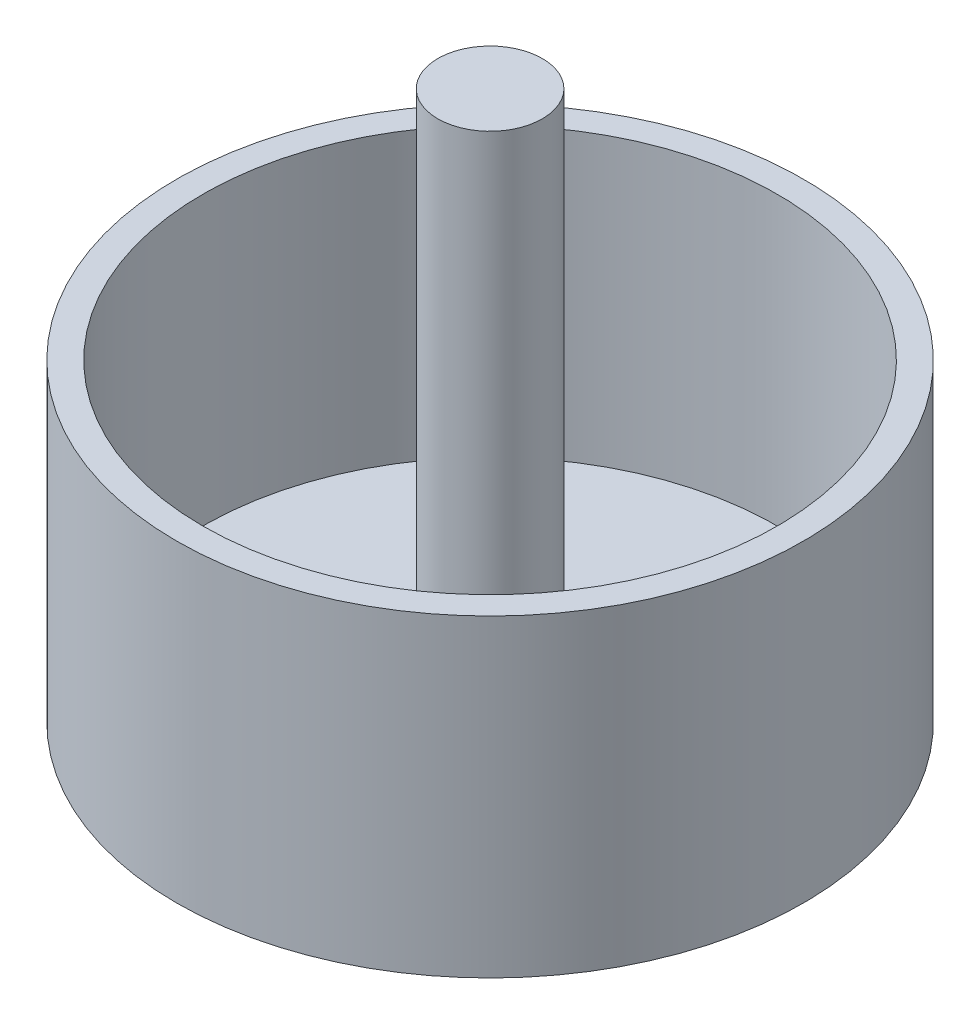
ISO-10303-21;
HEADER;
FILE_DESCRIPTION(('STEP AP214'),'2;1');
FILE_NAME('part.step','',(''),(''),'','','');
FILE_SCHEMA(('AUTOMOTIVE_DESIGN { 1 0 10303 214 1 1 1 1 }'));
ENDSEC;
DATA;
#1=APPLICATION_CONTEXT('core data for automotive mechanical design processes');
#2=APPLICATION_PROTOCOL_DEFINITION('international standard','automotive_design',2000,#1);
#3=PRODUCT_CONTEXT('',#1,'mechanical');
#4=PRODUCT('Part','Part','',(#3));
#5=PRODUCT_RELATED_PRODUCT_CATEGORY('part','',(#4));
#6=PRODUCT_DEFINITION_FORMATION('','',#4);
#7=PRODUCT_DEFINITION_CONTEXT('part definition',#1,'design');
#8=PRODUCT_DEFINITION('design','',#6,#7);
#9=PRODUCT_DEFINITION_SHAPE('','',#8);
#10=(LENGTH_UNIT() NAMED_UNIT(*) SI_UNIT(.MILLI.,.METRE.));
#11=(NAMED_UNIT(*) PLANE_ANGLE_UNIT() SI_UNIT($,.RADIAN.));
#12=(NAMED_UNIT(*) SI_UNIT($,.STERADIAN.) SOLID_ANGLE_UNIT());
#13=UNCERTAINTY_MEASURE_WITH_UNIT(LENGTH_MEASURE(1.E-05),#10,'distance_accuracy_value','');
#14=(GEOMETRIC_REPRESENTATION_CONTEXT(3) GLOBAL_UNCERTAINTY_ASSIGNED_CONTEXT((#13)) GLOBAL_UNIT_ASSIGNED_CONTEXT((#10,
#11,#12)) REPRESENTATION_CONTEXT('',''));
#15=CARTESIAN_POINT('',(0.,0.,0.));
#16=DIRECTION('',(0.,0.,1.));
#17=DIRECTION('',(1.,0.,0.));
#18=AXIS2_PLACEMENT_3D('',#15,#16,#17);
#19=CARTESIAN_POINT('',(0.,76.2,0.));
#20=DIRECTION('',(0.,-1.,0.));
#21=DIRECTION('',(0.,0.,-1.));
#22=AXIS2_PLACEMENT_3D('',#19,#20,#21);
#23=CYLINDRICAL_SURFACE('',#22,76.2);
#24=CARTESIAN_POINT('',(0.,76.2,0.));
#25=DIRECTION('',(0.,1.,0.));
#26=DIRECTION('',(0.,0.,1.));
#27=AXIS2_PLACEMENT_3D('',#24,#25,#26);
#28=CIRCLE('',#27,76.2);
#29=CARTESIAN_POINT('',(0.,76.2,76.2));
#30=VERTEX_POINT('',#29);
#31=EDGE_CURVE('E10',#30,#30,#28,.T.);
#32=ORIENTED_EDGE('',*,*,#31,.F.);
#33=EDGE_LOOP('',(#32));
#34=FACE_BOUND('',#33,.T.);
#35=CARTESIAN_POINT('',(0.,0.,0.));
#36=DIRECTION('',(0.,1.,0.));
#37=DIRECTION('',(0.,0.,1.));
#38=AXIS2_PLACEMENT_3D('',#35,#36,#37);
#39=CIRCLE('',#38,76.2);
#40=CARTESIAN_POINT('',(0.,0.,76.2));
#41=VERTEX_POINT('',#40);
#42=EDGE_CURVE('E48',#41,#41,#39,.T.);
#43=ORIENTED_EDGE('',*,*,#42,.T.);
#44=EDGE_LOOP('',(#43));
#45=FACE_BOUND('',#44,.T.);
#46=ADVANCED_FACE('F45',(#34,#45),#23,.T.);
#47=CARTESIAN_POINT('',(0.,76.2,0.));
#48=DIRECTION('',(0.,1.,0.));
#49=DIRECTION('',(0.,0.,1.));
#50=AXIS2_PLACEMENT_3D('',#47,#48,#49);
#51=PLANE('',#50);
#52=CARTESIAN_POINT('',(0.,76.2,0.));
#53=DIRECTION('',(0.,1.,0.));
#54=DIRECTION('',(0.,0.,1.));
#55=AXIS2_PLACEMENT_3D('',#52,#53,#54);
#56=CIRCLE('',#55,69.85);
#57=CARTESIAN_POINT('',(0.,76.2,69.85));
#58=VERTEX_POINT('',#57);
#59=EDGE_CURVE('E63',#58,#58,#56,.T.);
#60=ORIENTED_EDGE('',*,*,#59,.F.);
#61=EDGE_LOOP('',(#60));
#62=FACE_BOUND('',#61,.T.);
#63=ORIENTED_EDGE('',*,*,#31,.T.);
#64=EDGE_LOOP('',(#63));
#65=FACE_BOUND('',#64,.T.);
#66=ADVANCED_FACE('F91',(#62,#65),#51,.T.);
#67=CARTESIAN_POINT('',(0.,0.,0.));
#68=DIRECTION('',(0.,1.,0.));
#69=DIRECTION('',(0.,0.,1.));
#70=AXIS2_PLACEMENT_3D('',#67,#68,#69);
#71=PLANE('',#70);
#72=ORIENTED_EDGE('',*,*,#42,.F.);
#73=EDGE_LOOP('',(#72));
#74=FACE_BOUND('',#73,.T.);
#75=ADVANCED_FACE('F87',(#74),#71,.F.);
#76=CARTESIAN_POINT('',(0.,6.35000000000001,0.));
#77=DIRECTION('',(0.,1.,0.));
#78=DIRECTION('',(0.,0.,1.));
#79=AXIS2_PLACEMENT_3D('',#76,#77,#78);
#80=CYLINDRICAL_SURFACE('',#79,69.85);
#81=CARTESIAN_POINT('',(0.,6.35000000000001,0.));
#82=DIRECTION('',(0.,1.,0.));
#83=DIRECTION('',(0.,0.,1.));
#84=AXIS2_PLACEMENT_3D('',#81,#82,#83);
#85=CIRCLE('',#84,69.85);
#86=CARTESIAN_POINT('',(0.,6.35000000000001,69.85));
#87=VERTEX_POINT('',#86);
#88=EDGE_CURVE('E62',#87,#87,#85,.T.);
#89=ORIENTED_EDGE('',*,*,#88,.F.);
#90=EDGE_LOOP('',(#89));
#91=FACE_BOUND('',#90,.T.);
#92=ORIENTED_EDGE('',*,*,#59,.T.);
#93=EDGE_LOOP('',(#92));
#94=FACE_BOUND('',#93,.T.);
#95=ADVANCED_FACE('F81',(#91,#94),#80,.F.);
#96=CARTESIAN_POINT('',(0.,6.35000000000001,0.));
#97=DIRECTION('',(0.,1.,0.));
#98=DIRECTION('',(0.,0.,1.));
#99=AXIS2_PLACEMENT_3D('',#96,#97,#98);
#100=PLANE('',#99);
#101=CARTESIAN_POINT('',(0.,6.35000000000001,0.));
#102=DIRECTION('',(0.,1.,0.));
#103=DIRECTION('',(0.,0.,1.));
#104=AXIS2_PLACEMENT_3D('',#101,#102,#103);
#105=CIRCLE('',#104,12.7);
#106=CARTESIAN_POINT('',(0.,6.35000000000001,12.7));
#107=VERTEX_POINT('',#106);
#108=EDGE_CURVE('E67',#107,#107,#105,.T.);
#109=ORIENTED_EDGE('',*,*,#108,.F.);
#110=EDGE_LOOP('',(#109));
#111=FACE_BOUND('',#110,.T.);
#112=ORIENTED_EDGE('',*,*,#88,.T.);
#113=EDGE_LOOP('',(#112));
#114=FACE_BOUND('',#113,.T.);
#115=ADVANCED_FACE('F77',(#111,#114),#100,.T.);
#116=CARTESIAN_POINT('',(0.,133.35,0.));
#117=DIRECTION('',(0.,1.,0.));
#118=DIRECTION('',(0.,0.,1.));
#119=AXIS2_PLACEMENT_3D('',#116,#117,#118);
#120=PLANE('',#119);
#121=CARTESIAN_POINT('',(0.,133.35,0.));
#122=DIRECTION('',(0.,1.,0.));
#123=DIRECTION('',(0.,0.,1.));
#124=AXIS2_PLACEMENT_3D('',#121,#122,#123);
#125=CIRCLE('',#124,12.7);
#126=CARTESIAN_POINT('',(0.,133.35,12.7));
#127=VERTEX_POINT('',#126);
#128=EDGE_CURVE('E57',#127,#127,#125,.T.);
#129=ORIENTED_EDGE('',*,*,#128,.T.);
#130=EDGE_LOOP('',(#129));
#131=FACE_BOUND('',#130,.T.);
#132=ADVANCED_FACE('F80',(#131),#120,.T.);
#133=CARTESIAN_POINT('',(0.,133.35,0.));
#134=DIRECTION('',(0.,-1.,0.));
#135=DIRECTION('',(0.,0.,-1.));
#136=AXIS2_PLACEMENT_3D('',#133,#134,#135);
#137=CYLINDRICAL_SURFACE('',#136,12.7);
#138=ORIENTED_EDGE('',*,*,#128,.F.);
#139=EDGE_LOOP('',(#138));
#140=FACE_BOUND('',#139,.T.);
#141=ORIENTED_EDGE('',*,*,#108,.T.);
#142=EDGE_LOOP('',(#141));
#143=FACE_BOUND('',#142,.T.);
#144=ADVANCED_FACE('F75',(#140,#143),#137,.T.);
#145=CLOSED_SHELL('',(#46,#66,#75,#95,#115,#132,#144));
#146=MANIFOLD_SOLID_BREP('B2',#145);
#147=ADVANCED_BREP_SHAPE_REPRESENTATION('',(#18,#146),#14);
#148=SHAPE_DEFINITION_REPRESENTATION(#9,#147);
ENDSEC;
END-ISO-10303-21;
